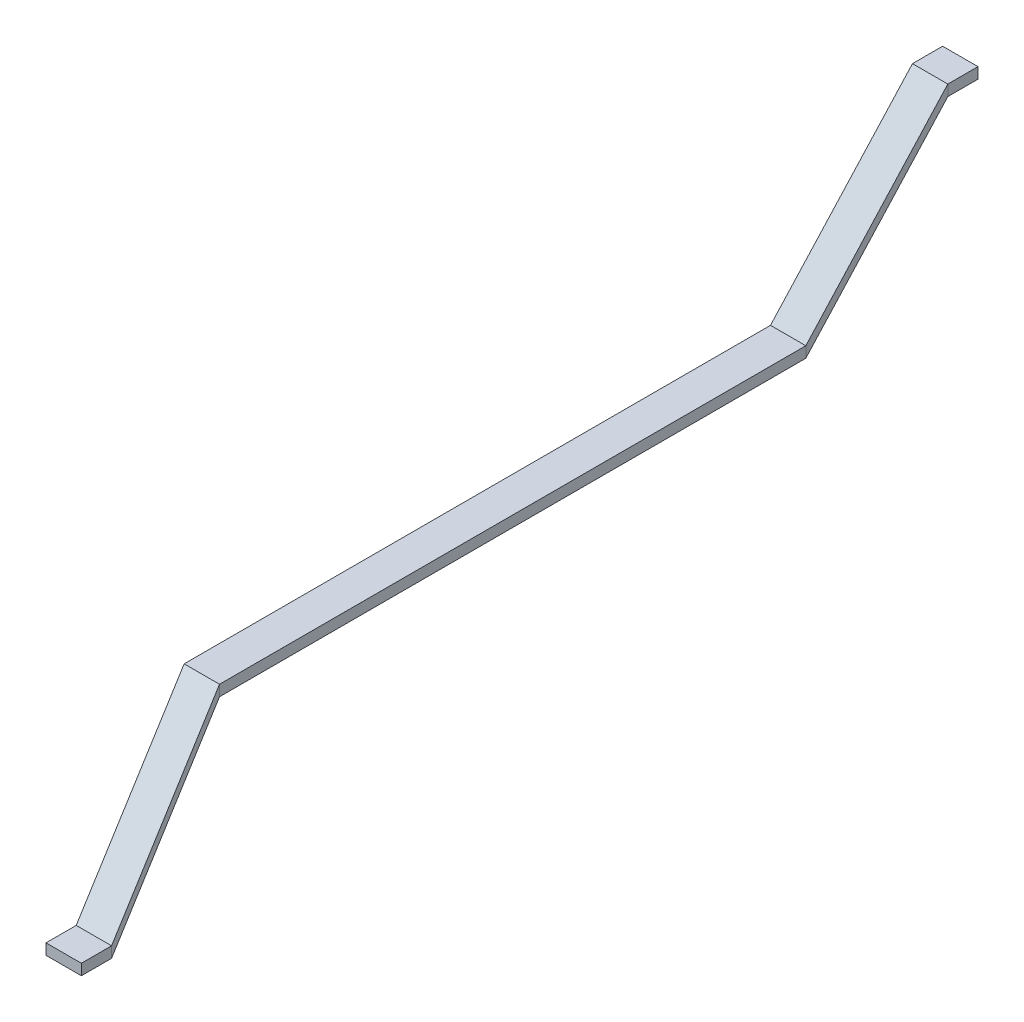
ISO-10303-21;
HEADER;
FILE_DESCRIPTION(('STEP AP214'),'2;1');
FILE_NAME('part.step','',(''),(''),'','','');
FILE_SCHEMA(('AUTOMOTIVE_DESIGN { 1 0 10303 214 1 1 1 1 }'));
ENDSEC;
DATA;
#1=APPLICATION_CONTEXT('core data for automotive mechanical design processes');
#2=APPLICATION_PROTOCOL_DEFINITION('international standard','automotive_design',2000,#1);
#3=PRODUCT_CONTEXT('',#1,'mechanical');
#4=PRODUCT('Part','Part','',(#3));
#5=PRODUCT_RELATED_PRODUCT_CATEGORY('part','',(#4));
#6=PRODUCT_DEFINITION_FORMATION('','',#4);
#7=PRODUCT_DEFINITION_CONTEXT('part definition',#1,'design');
#8=PRODUCT_DEFINITION('design','',#6,#7);
#9=PRODUCT_DEFINITION_SHAPE('','',#8);
#10=(LENGTH_UNIT() NAMED_UNIT(*) SI_UNIT(.MILLI.,.METRE.));
#11=(NAMED_UNIT(*) PLANE_ANGLE_UNIT() SI_UNIT($,.RADIAN.));
#12=(NAMED_UNIT(*) SI_UNIT($,.STERADIAN.) SOLID_ANGLE_UNIT());
#13=UNCERTAINTY_MEASURE_WITH_UNIT(LENGTH_MEASURE(1.E-05),#10,'distance_accuracy_value','');
#14=(GEOMETRIC_REPRESENTATION_CONTEXT(3) GLOBAL_UNCERTAINTY_ASSIGNED_CONTEXT((#13)) GLOBAL_UNIT_ASSIGNED_CONTEXT((#10,
#11,#12)) REPRESENTATION_CONTEXT('',''));
#15=CARTESIAN_POINT('',(0.,0.,0.));
#16=DIRECTION('',(0.,0.,1.));
#17=DIRECTION('',(1.,0.,0.));
#18=AXIS2_PLACEMENT_3D('',#15,#16,#17);
#19=CARTESIAN_POINT('',(0.,0.,-310.));
#20=DIRECTION('',(0.,0.,1.));
#21=DIRECTION('',(1.,0.,0.));
#22=AXIS2_PLACEMENT_3D('',#19,#20,#21);
#23=PLANE('',#22);
#24=DIRECTION('',(0.,-1.,0.));
#25=VECTOR('',#24,1.);
#26=CARTESIAN_POINT('',(3212.66029065679,352.155989281594,-310.));
#27=LINE('',#26,#25);
#28=CARTESIAN_POINT('',(3212.66029065679,352.155989281594,-310.));
#29=VERTEX_POINT('',#28);
#30=CARTESIAN_POINT('',(3212.66029065679,330.555989281594,-310.));
#31=VERTEX_POINT('',#30);
#32=EDGE_CURVE('E128',#29,#31,#27,.T.);
#33=ORIENTED_EDGE('',*,*,#32,.F.);
#34=DIRECTION('',(-1.,0.,0.));
#35=VECTOR('',#34,1.);
#36=CARTESIAN_POINT('',(3212.66029065679,352.155989281594,-310.));
#37=LINE('',#36,#35);
#38=CARTESIAN_POINT('',(3282.91029065679,352.155989281594,-310.));
#39=VERTEX_POINT('',#38);
#40=EDGE_CURVE('E40',#39,#29,#37,.T.);
#41=ORIENTED_EDGE('',*,*,#40,.F.);
#42=DIRECTION('',(0.,1.,0.));
#43=VECTOR('',#42,1.);
#44=CARTESIAN_POINT('',(3282.91029065679,352.155989281594,-310.));
#45=LINE('',#44,#43);
#46=CARTESIAN_POINT('',(3282.91029065679,330.555989281594,-310.));
#47=VERTEX_POINT('',#46);
#48=EDGE_CURVE('E117',#47,#39,#45,.T.);
#49=ORIENTED_EDGE('',*,*,#48,.F.);
#50=DIRECTION('',(1.,0.,0.));
#51=VECTOR('',#50,1.);
#52=CARTESIAN_POINT('',(3212.66029065679,330.555989281594,-310.));
#53=LINE('',#52,#51);
#54=EDGE_CURVE('E111',#31,#47,#53,.T.);
#55=ORIENTED_EDGE('',*,*,#54,.F.);
#56=EDGE_LOOP('',(#33,#41,#49,#55));
#57=FACE_BOUND('',#56,.T.);
#58=ADVANCED_FACE('F37',(#57),#23,.F.);
#59=CARTESIAN_POINT('',(3.39652809837787,-648.683155378033,1475.));
#60=DIRECTION('',(0.,0.,1.));
#61=DIRECTION('',(1.,0.,0.));
#62=AXIS2_PLACEMENT_3D('',#59,#60,#61);
#63=PLANE('',#62);
#64=DIRECTION('',(0.,-1.,0.));
#65=VECTOR('',#64,1.);
#66=CARTESIAN_POINT('',(3216.05681875516,-296.527166096439,1475.));
#67=LINE('',#66,#65);
#68=CARTESIAN_POINT('',(3216.05681875516,-296.527166096439,1475.));
#69=VERTEX_POINT('',#68);
#70=CARTESIAN_POINT('',(3216.05681875516,-318.127166096439,1475.));
#71=VERTEX_POINT('',#70);
#72=EDGE_CURVE('E184',#69,#71,#67,.T.);
#73=ORIENTED_EDGE('',*,*,#72,.T.);
#74=DIRECTION('',(1.,0.,0.));
#75=VECTOR('',#74,1.);
#76=CARTESIAN_POINT('',(3216.05681875516,-318.127166096439,1475.));
#77=LINE('',#76,#75);
#78=CARTESIAN_POINT('',(3286.30681875516,-318.127166096439,1475.));
#79=VERTEX_POINT('',#78);
#80=EDGE_CURVE('E213',#71,#79,#77,.T.);
#81=ORIENTED_EDGE('',*,*,#80,.T.);
#82=DIRECTION('',(0.,1.,0.));
#83=VECTOR('',#82,1.);
#84=CARTESIAN_POINT('',(3286.30681875516,-296.527166096439,1475.));
#85=LINE('',#84,#83);
#86=CARTESIAN_POINT('',(3286.30681875516,-296.527166096439,1475.));
#87=VERTEX_POINT('',#86);
#88=EDGE_CURVE('E206',#79,#87,#85,.T.);
#89=ORIENTED_EDGE('',*,*,#88,.T.);
#90=DIRECTION('',(-1.,0.,0.));
#91=VECTOR('',#90,1.);
#92=CARTESIAN_POINT('',(3216.05681875516,-296.527166096439,1475.));
#93=LINE('',#92,#91);
#94=EDGE_CURVE('E202',#87,#69,#93,.T.);
#95=ORIENTED_EDGE('',*,*,#94,.T.);
#96=EDGE_LOOP('',(#73,#81,#89,#95));
#97=FACE_BOUND('',#96,.T.);
#98=ADVANCED_FACE('F232',(#97),#63,.T.);
#99=CARTESIAN_POINT('',(3212.66029065679,352.155989281594,-250.));
#100=DIRECTION('',(1.,0.,0.));
#101=DIRECTION('',(0.,0.,-1.));
#102=AXIS2_PLACEMENT_3D('',#99,#100,#101);
#103=PLANE('',#102);
#104=DIRECTION('',(0.,0.,-1.));
#105=VECTOR('',#104,1.);
#106=CARTESIAN_POINT('',(3212.66029065679,330.555989281594,-250.));
#107=LINE('',#106,#105);
#108=CARTESIAN_POINT('',(3212.66029065679,330.555989281594,-250.));
#109=VERTEX_POINT('',#108);
#110=EDGE_CURVE('E139',#109,#31,#107,.T.);
#111=ORIENTED_EDGE('',*,*,#110,.F.);
#112=DIRECTION('',(0.,-1.,0.));
#113=VECTOR('',#112,1.);
#114=CARTESIAN_POINT('',(3212.66029065679,352.155989281594,-250.));
#115=LINE('',#114,#113);
#116=CARTESIAN_POINT('',(3212.66029065679,352.155989281594,-250.));
#117=VERTEX_POINT('',#116);
#118=EDGE_CURVE('E158',#117,#109,#115,.T.);
#119=ORIENTED_EDGE('',*,*,#118,.F.);
#120=DIRECTION('',(0.,0.,-1.));
#121=VECTOR('',#120,1.);
#122=CARTESIAN_POINT('',(3212.66029065679,352.155989281594,-250.));
#123=LINE('',#122,#121);
#124=EDGE_CURVE('E140',#117,#29,#123,.T.);
#125=ORIENTED_EDGE('',*,*,#124,.T.);
#126=ORIENTED_EDGE('',*,*,#32,.T.);
#127=EDGE_LOOP('',(#111,#119,#125,#126));
#128=FACE_BOUND('',#127,.T.);
#129=ADVANCED_FACE('F313',(#128),#103,.F.);
#130=CARTESIAN_POINT('',(3212.66029065679,330.555989281594,-250.));
#131=DIRECTION('',(0.,1.,0.));
#132=DIRECTION('',(0.,0.,1.));
#133=AXIS2_PLACEMENT_3D('',#130,#131,#132);
#134=PLANE('',#133);
#135=DIRECTION('',(0.,0.,-1.));
#136=VECTOR('',#135,1.);
#137=CARTESIAN_POINT('',(3282.91029065679,330.555989281594,-250.));
#138=LINE('',#137,#136);
#139=CARTESIAN_POINT('',(3282.91029065679,330.555989281594,-250.));
#140=VERTEX_POINT('',#139);
#141=EDGE_CURVE('E124',#140,#47,#138,.T.);
#142=ORIENTED_EDGE('',*,*,#141,.F.);
#143=DIRECTION('',(1.,0.,0.));
#144=VECTOR('',#143,1.);
#145=CARTESIAN_POINT('',(3212.66029065679,330.555989281594,-250.));
#146=LINE('',#145,#144);
#147=EDGE_CURVE('E153',#109,#140,#146,.T.);
#148=ORIENTED_EDGE('',*,*,#147,.F.);
#149=ORIENTED_EDGE('',*,*,#110,.T.);
#150=ORIENTED_EDGE('',*,*,#54,.T.);
#151=EDGE_LOOP('',(#142,#148,#149,#150));
#152=FACE_BOUND('',#151,.T.);
#153=ADVANCED_FACE('F316',(#152),#134,.F.);
#154=CARTESIAN_POINT('',(3282.91029065679,352.155989281594,-250.));
#155=DIRECTION('',(-1.,0.,0.));
#156=DIRECTION('',(0.,0.,1.));
#157=AXIS2_PLACEMENT_3D('',#154,#155,#156);
#158=PLANE('',#157);
#159=DIRECTION('',(0.,0.,-1.));
#160=VECTOR('',#159,1.);
#161=CARTESIAN_POINT('',(3282.91029065679,352.155989281594,-250.));
#162=LINE('',#161,#160);
#163=CARTESIAN_POINT('',(3282.91029065679,352.155989281594,-250.));
#164=VERTEX_POINT('',#163);
#165=EDGE_CURVE('E122',#164,#39,#162,.T.);
#166=ORIENTED_EDGE('',*,*,#165,.F.);
#167=DIRECTION('',(0.,1.,0.));
#168=VECTOR('',#167,1.);
#169=CARTESIAN_POINT('',(3282.91029065679,352.155989281594,-250.));
#170=LINE('',#169,#168);
#171=EDGE_CURVE('E148',#140,#164,#170,.T.);
#172=ORIENTED_EDGE('',*,*,#171,.F.);
#173=ORIENTED_EDGE('',*,*,#141,.T.);
#174=ORIENTED_EDGE('',*,*,#48,.T.);
#175=EDGE_LOOP('',(#166,#172,#173,#174));
#176=FACE_BOUND('',#175,.T.);
#177=ADVANCED_FACE('F119',(#176),#158,.F.);
#178=CARTESIAN_POINT('',(3212.66029065679,352.155989281594,-250.));
#179=DIRECTION('',(0.,-1.,0.));
#180=DIRECTION('',(0.,0.,-1.));
#181=AXIS2_PLACEMENT_3D('',#178,#179,#180);
#182=PLANE('',#181);
#183=ORIENTED_EDGE('',*,*,#40,.T.);
#184=ORIENTED_EDGE('',*,*,#124,.F.);
#185=DIRECTION('',(-1.,0.,0.));
#186=VECTOR('',#185,1.);
#187=CARTESIAN_POINT('',(3212.66029065679,352.155989281594,-250.));
#188=LINE('',#187,#186);
#189=EDGE_CURVE('E134',#164,#117,#188,.T.);
#190=ORIENTED_EDGE('',*,*,#189,.F.);
#191=ORIENTED_EDGE('',*,*,#165,.T.);
#192=EDGE_LOOP('',(#183,#184,#190,#191));
#193=FACE_BOUND('',#192,.T.);
#194=ADVANCED_FACE('F133',(#193),#182,.F.);
#195=CARTESIAN_POINT('',(3180.55,10.8,3.88578058618805E-13));
#196=DIRECTION('',(0.991852109035906,0.,0.127394638038751));
#197=DIRECTION('',(0.127394638038751,0.,-0.991852109035906));
#198=AXIS2_PLACEMENT_3D('',#195,#196,#197);
#199=PLANE('',#198);
#200=DIRECTION('',(0.0756731243531519,0.804460928171051,-0.58916567559287));
#201=VECTOR('',#200,1.);
#202=CARTESIAN_POINT('',(3180.55,-10.8,3.88578058618805E-13));
#203=LINE('',#202,#201);
#204=CARTESIAN_POINT('',(3180.55,-10.8,4.16333634234434E-13));
#205=VERTEX_POINT('',#204);
#206=EDGE_CURVE('E155',#205,#109,#203,.T.);
#207=ORIENTED_EDGE('',*,*,#206,.F.);
#208=DIRECTION('',(0.,-1.,0.));
#209=VECTOR('',#208,1.);
#210=CARTESIAN_POINT('',(3180.55,10.8,3.88578058618805E-13));
#211=LINE('',#210,#209);
#212=CARTESIAN_POINT('',(3180.55,10.8,4.16333634234434E-13));
#213=VERTEX_POINT('',#212);
#214=EDGE_CURVE('E178',#213,#205,#211,.T.);
#215=ORIENTED_EDGE('',*,*,#214,.F.);
#216=DIRECTION('',(0.0756731243531519,0.804460928171051,-0.58916567559287));
#217=VECTOR('',#216,1.);
#218=CARTESIAN_POINT('',(3180.55,10.8,3.88578058618805E-13));
#219=LINE('',#218,#217);
#220=EDGE_CURVE('E132',#213,#117,#219,.T.);
#221=ORIENTED_EDGE('',*,*,#220,.T.);
#222=ORIENTED_EDGE('',*,*,#118,.T.);
#223=EDGE_LOOP('',(#207,#215,#221,#222));
#224=FACE_BOUND('',#223,.T.);
#225=ADVANCED_FACE('F298',(#224),#199,.F.);
#226=CARTESIAN_POINT('',(3180.55,-10.8,3.88578058618805E-13));
#227=DIRECTION('',(0.,0.590859860858935,0.806774209321146));
#228=DIRECTION('',(0.,-0.806774209321146,0.590859860858935));
#229=AXIS2_PLACEMENT_3D('',#226,#227,#228);
#230=PLANE('',#229);
#231=DIRECTION('',(0.0756731243531519,0.804460928171051,-0.58916567559287));
#232=VECTOR('',#231,1.);
#233=CARTESIAN_POINT('',(3250.8,-10.8,3.88578058618805E-13));
#234=LINE('',#233,#232);
#235=CARTESIAN_POINT('',(3250.8,-10.8,4.16333634234434E-13));
#236=VERTEX_POINT('',#235);
#237=EDGE_CURVE('E150',#236,#140,#234,.T.);
#238=ORIENTED_EDGE('',*,*,#237,.F.);
#239=DIRECTION('',(1.,0.,0.));
#240=VECTOR('',#239,1.);
#241=CARTESIAN_POINT('',(3180.55,-10.8,3.88578058618805E-13));
#242=LINE('',#241,#240);
#243=EDGE_CURVE('E173',#205,#236,#242,.T.);
#244=ORIENTED_EDGE('',*,*,#243,.F.);
#245=ORIENTED_EDGE('',*,*,#206,.T.);
#246=ORIENTED_EDGE('',*,*,#147,.T.);
#247=EDGE_LOOP('',(#238,#244,#245,#246));
#248=FACE_BOUND('',#247,.T.);
#249=ADVANCED_FACE('F301',(#248),#230,.F.);
#250=CARTESIAN_POINT('',(3250.8,10.8,3.88578058618805E-13));
#251=DIRECTION('',(-0.991852109035906,0.,-0.127394638038751));
#252=DIRECTION('',(-0.127394638038751,0.,0.991852109035906));
#253=AXIS2_PLACEMENT_3D('',#250,#251,#252);
#254=PLANE('',#253);
#255=DIRECTION('',(0.0756731243531519,0.804460928171051,-0.58916567559287));
#256=VECTOR('',#255,1.);
#257=CARTESIAN_POINT('',(3250.8,10.8,3.88578058618805E-13));
#258=LINE('',#257,#256);
#259=CARTESIAN_POINT('',(3250.8,10.8,4.16333634234434E-13));
#260=VERTEX_POINT('',#259);
#261=EDGE_CURVE('E146',#260,#164,#258,.T.);
#262=ORIENTED_EDGE('',*,*,#261,.F.);
#263=DIRECTION('',(0.,1.,0.));
#264=VECTOR('',#263,1.);
#265=CARTESIAN_POINT('',(3250.8,10.8,3.88578058618805E-13));
#266=LINE('',#265,#264);
#267=EDGE_CURVE('E168',#236,#260,#266,.T.);
#268=ORIENTED_EDGE('',*,*,#267,.F.);
#269=ORIENTED_EDGE('',*,*,#237,.T.);
#270=ORIENTED_EDGE('',*,*,#171,.T.);
#271=EDGE_LOOP('',(#262,#268,#269,#270));
#272=FACE_BOUND('',#271,.T.);
#273=ADVANCED_FACE('F305',(#272),#254,.F.);
#274=CARTESIAN_POINT('',(3180.55,10.8,3.88578058618805E-13));
#275=DIRECTION('',(0.,-0.590859860858935,-0.806774209321146));
#276=DIRECTION('',(0.,0.806774209321146,-0.590859860858935));
#277=AXIS2_PLACEMENT_3D('',#274,#275,#276);
#278=PLANE('',#277);
#279=ORIENTED_EDGE('',*,*,#189,.T.);
#280=ORIENTED_EDGE('',*,*,#220,.F.);
#281=DIRECTION('',(-1.,0.,0.));
#282=VECTOR('',#281,1.);
#283=CARTESIAN_POINT('',(3180.55,10.8,3.88578058618805E-13));
#284=LINE('',#283,#282);
#285=EDGE_CURVE('E162',#260,#213,#284,.T.);
#286=ORIENTED_EDGE('',*,*,#285,.F.);
#287=ORIENTED_EDGE('',*,*,#261,.T.);
#288=EDGE_LOOP('',(#279,#280,#286,#287));
#289=FACE_BOUND('',#288,.T.);
#290=ADVANCED_FACE('F286',(#289),#278,.F.);
#291=CARTESIAN_POINT('',(3180.55,10.8,1165.));
#292=DIRECTION('',(1.,0.,0.));
#293=DIRECTION('',(0.,0.,-1.));
#294=AXIS2_PLACEMENT_3D('',#291,#292,#293);
#295=PLANE('',#294);
#296=DIRECTION('',(0.,0.,-1.));
#297=VECTOR('',#296,1.);
#298=CARTESIAN_POINT('',(3180.55,-10.8,1165.));
#299=LINE('',#298,#297);
#300=CARTESIAN_POINT('',(3180.55,-10.8,1165.));
#301=VERTEX_POINT('',#300);
#302=EDGE_CURVE('E175',#301,#205,#299,.T.);
#303=ORIENTED_EDGE('',*,*,#302,.F.);
#304=DIRECTION('',(0.,-1.,0.));
#305=VECTOR('',#304,1.);
#306=CARTESIAN_POINT('',(3180.55,10.8,1165.));
#307=LINE('',#306,#305);
#308=CARTESIAN_POINT('',(3180.55,10.8,1165.));
#309=VERTEX_POINT('',#308);
#310=EDGE_CURVE('E198',#309,#301,#307,.T.);
#311=ORIENTED_EDGE('',*,*,#310,.F.);
#312=DIRECTION('',(0.,0.,-1.));
#313=VECTOR('',#312,1.);
#314=CARTESIAN_POINT('',(3180.55,10.8,1165.));
#315=LINE('',#314,#313);
#316=EDGE_CURVE('E145',#309,#213,#315,.T.);
#317=ORIENTED_EDGE('',*,*,#316,.T.);
#318=ORIENTED_EDGE('',*,*,#214,.T.);
#319=EDGE_LOOP('',(#303,#311,#317,#318));
#320=FACE_BOUND('',#319,.T.);
#321=ADVANCED_FACE('F282',(#320),#295,.F.);
#322=CARTESIAN_POINT('',(3180.55,-10.8,1165.));
#323=DIRECTION('',(0.,1.,0.));
#324=DIRECTION('',(0.,0.,1.));
#325=AXIS2_PLACEMENT_3D('',#322,#323,#324);
#326=PLANE('',#325);
#327=DIRECTION('',(0.,0.,-1.));
#328=VECTOR('',#327,1.);
#329=CARTESIAN_POINT('',(3250.8,-10.8,1165.));
#330=LINE('',#329,#328);
#331=CARTESIAN_POINT('',(3250.8,-10.8,1165.));
#332=VERTEX_POINT('',#331);
#333=EDGE_CURVE('E170',#332,#236,#330,.T.);
#334=ORIENTED_EDGE('',*,*,#333,.F.);
#335=DIRECTION('',(1.,0.,0.));
#336=VECTOR('',#335,1.);
#337=CARTESIAN_POINT('',(3180.55,-10.8,1165.));
#338=LINE('',#337,#336);
#339=EDGE_CURVE('E193',#301,#332,#338,.T.);
#340=ORIENTED_EDGE('',*,*,#339,.F.);
#341=ORIENTED_EDGE('',*,*,#302,.T.);
#342=ORIENTED_EDGE('',*,*,#243,.T.);
#343=EDGE_LOOP('',(#334,#340,#341,#342));
#344=FACE_BOUND('',#343,.T.);
#345=ADVANCED_FACE('F285',(#344),#326,.F.);
#346=CARTESIAN_POINT('',(3250.8,10.8,1165.));
#347=DIRECTION('',(-1.,0.,0.));
#348=DIRECTION('',(0.,0.,1.));
#349=AXIS2_PLACEMENT_3D('',#346,#347,#348);
#350=PLANE('',#349);
#351=DIRECTION('',(0.,0.,-1.));
#352=VECTOR('',#351,1.);
#353=CARTESIAN_POINT('',(3250.8,10.8,1165.));
#354=LINE('',#353,#352);
#355=CARTESIAN_POINT('',(3250.8,10.8,1165.));
#356=VERTEX_POINT('',#355);
#357=EDGE_CURVE('E165',#356,#260,#354,.T.);
#358=ORIENTED_EDGE('',*,*,#357,.F.);
#359=DIRECTION('',(0.,1.,0.));
#360=VECTOR('',#359,1.);
#361=CARTESIAN_POINT('',(3250.8,10.8,1165.));
#362=LINE('',#361,#360);
#363=EDGE_CURVE('E188',#332,#356,#362,.T.);
#364=ORIENTED_EDGE('',*,*,#363,.F.);
#365=ORIENTED_EDGE('',*,*,#333,.T.);
#366=ORIENTED_EDGE('',*,*,#267,.T.);
#367=EDGE_LOOP('',(#358,#364,#365,#366));
#368=FACE_BOUND('',#367,.T.);
#369=ADVANCED_FACE('F290',(#368),#350,.F.);
#370=CARTESIAN_POINT('',(3180.55,10.8,1165.));
#371=DIRECTION('',(0.,-1.,0.));
#372=DIRECTION('',(0.,0.,-1.));
#373=AXIS2_PLACEMENT_3D('',#370,#371,#372);
#374=PLANE('',#373);
#375=ORIENTED_EDGE('',*,*,#285,.T.);
#376=ORIENTED_EDGE('',*,*,#316,.F.);
#377=DIRECTION('',(-1.,0.,0.));
#378=VECTOR('',#377,1.);
#379=CARTESIAN_POINT('',(3180.55,10.8,1165.));
#380=LINE('',#379,#378);
#381=EDGE_CURVE('E182',#356,#309,#380,.T.);
#382=ORIENTED_EDGE('',*,*,#381,.F.);
#383=ORIENTED_EDGE('',*,*,#357,.T.);
#384=EDGE_LOOP('',(#375,#376,#382,#383));
#385=FACE_BOUND('',#384,.T.);
#386=ADVANCED_FACE('F269',(#385),#374,.F.);
#387=CARTESIAN_POINT('',(3216.05681875516,-296.527166096439,1415.));
#388=DIRECTION('',(0.990064193344772,0.,-0.140616119476277));
#389=DIRECTION('',(-0.140616119476277,0.,-0.990064193344772));
#390=AXIS2_PLACEMENT_3D('',#387,#388,#389);
#391=PLANE('',#390);
#392=DIRECTION('',(-0.0892675896064656,0.772650333086406,-0.628524271788543));
#393=VECTOR('',#392,1.);
#394=CARTESIAN_POINT('',(3216.05681875516,-318.127166096439,1415.));
#395=LINE('',#394,#393);
#396=CARTESIAN_POINT('',(3216.05681875516,-318.127166096439,1415.));
#397=VERTEX_POINT('',#396);
#398=EDGE_CURVE('E195',#397,#301,#395,.T.);
#399=ORIENTED_EDGE('',*,*,#398,.F.);
#400=DIRECTION('',(0.,-1.,0.));
#401=VECTOR('',#400,1.);
#402=CARTESIAN_POINT('',(3216.05681875516,-296.527166096439,1415.));
#403=LINE('',#402,#401);
#404=CARTESIAN_POINT('',(3216.05681875516,-296.527166096439,1415.));
#405=VERTEX_POINT('',#404);
#406=EDGE_CURVE('E222',#405,#397,#403,.T.);
#407=ORIENTED_EDGE('',*,*,#406,.F.);
#408=DIRECTION('',(-0.0892675896064656,0.772650333086406,-0.628524271788543));
#409=VECTOR('',#408,1.);
#410=CARTESIAN_POINT('',(3216.05681875516,-296.527166096439,1415.));
#411=LINE('',#410,#409);
#412=EDGE_CURVE('E164',#405,#309,#411,.T.);
#413=ORIENTED_EDGE('',*,*,#412,.T.);
#414=ORIENTED_EDGE('',*,*,#310,.T.);
#415=EDGE_LOOP('',(#399,#407,#413,#414));
#416=FACE_BOUND('',#415,.T.);
#417=ADVANCED_FACE('F265',(#416),#391,.F.);
#418=CARTESIAN_POINT('',(3216.05681875516,-318.127166096439,1415.));
#419=DIRECTION('',(0.,0.63104360014591,0.775747365264549));
#420=DIRECTION('',(0.,-0.775747365264549,0.63104360014591));
#421=AXIS2_PLACEMENT_3D('',#418,#419,#420);
#422=PLANE('',#421);
#423=DIRECTION('',(-0.0892675896064656,0.772650333086406,-0.628524271788543));
#424=VECTOR('',#423,1.);
#425=CARTESIAN_POINT('',(3286.30681875516,-318.127166096439,1415.));
#426=LINE('',#425,#424);
#427=CARTESIAN_POINT('',(3286.30681875516,-318.127166096439,1415.));
#428=VERTEX_POINT('',#427);
#429=EDGE_CURVE('E190',#428,#332,#426,.T.);
#430=ORIENTED_EDGE('',*,*,#429,.F.);
#431=DIRECTION('',(1.,0.,0.));
#432=VECTOR('',#431,1.);
#433=CARTESIAN_POINT('',(3216.05681875516,-318.127166096439,1415.));
#434=LINE('',#433,#432);
#435=EDGE_CURVE('E215',#397,#428,#434,.T.);
#436=ORIENTED_EDGE('',*,*,#435,.F.);
#437=ORIENTED_EDGE('',*,*,#398,.T.);
#438=ORIENTED_EDGE('',*,*,#339,.T.);
#439=EDGE_LOOP('',(#430,#436,#437,#438));
#440=FACE_BOUND('',#439,.T.);
#441=ADVANCED_FACE('F268',(#440),#422,.F.);
#442=CARTESIAN_POINT('',(3286.30681875516,-296.527166096439,1415.));
#443=DIRECTION('',(-0.990064193344772,0.,0.140616119476277));
#444=DIRECTION('',(0.140616119476277,0.,0.990064193344772));
#445=AXIS2_PLACEMENT_3D('',#442,#443,#444);
#446=PLANE('',#445);
#447=DIRECTION('',(-0.0892675896064656,0.772650333086406,-0.628524271788543));
#448=VECTOR('',#447,1.);
#449=CARTESIAN_POINT('',(3286.30681875516,-296.527166096439,1415.));
#450=LINE('',#449,#448);
#451=CARTESIAN_POINT('',(3286.30681875516,-296.527166096439,1415.));
#452=VERTEX_POINT('',#451);
#453=EDGE_CURVE('E185',#452,#356,#450,.T.);
#454=ORIENTED_EDGE('',*,*,#453,.F.);
#455=DIRECTION('',(0.,1.,0.));
#456=VECTOR('',#455,1.);
#457=CARTESIAN_POINT('',(3286.30681875516,-296.527166096439,1415.));
#458=LINE('',#457,#456);
#459=EDGE_CURVE('E55',#428,#452,#458,.T.);
#460=ORIENTED_EDGE('',*,*,#459,.F.);
#461=ORIENTED_EDGE('',*,*,#429,.T.);
#462=ORIENTED_EDGE('',*,*,#363,.T.);
#463=EDGE_LOOP('',(#454,#460,#461,#462));
#464=FACE_BOUND('',#463,.T.);
#465=ADVANCED_FACE('F273',(#464),#446,.F.);
#466=CARTESIAN_POINT('',(3216.05681875516,-296.527166096439,1415.));
#467=DIRECTION('',(0.,-0.63104360014591,-0.775747365264549));
#468=DIRECTION('',(0.,0.775747365264549,-0.63104360014591));
#469=AXIS2_PLACEMENT_3D('',#466,#467,#468);
#470=PLANE('',#469);
#471=ORIENTED_EDGE('',*,*,#381,.T.);
#472=ORIENTED_EDGE('',*,*,#412,.F.);
#473=DIRECTION('',(-1.,0.,0.));
#474=VECTOR('',#473,1.);
#475=CARTESIAN_POINT('',(3216.05681875516,-296.527166096439,1415.));
#476=LINE('',#475,#474);
#477=EDGE_CURVE('E11',#452,#405,#476,.T.);
#478=ORIENTED_EDGE('',*,*,#477,.F.);
#479=ORIENTED_EDGE('',*,*,#453,.T.);
#480=EDGE_LOOP('',(#471,#472,#478,#479));
#481=FACE_BOUND('',#480,.T.);
#482=ADVANCED_FACE('F277',(#481),#470,.F.);
#483=CARTESIAN_POINT('',(3216.05681875516,-296.527166096439,1475.));
#484=DIRECTION('',(1.,0.,0.));
#485=DIRECTION('',(0.,0.,-1.));
#486=AXIS2_PLACEMENT_3D('',#483,#484,#485);
#487=PLANE('',#486);
#488=DIRECTION('',(0.,0.,-1.));
#489=VECTOR('',#488,1.);
#490=CARTESIAN_POINT('',(3216.05681875516,-318.127166096439,1475.));
#491=LINE('',#490,#489);
#492=EDGE_CURVE('E217',#71,#397,#491,.T.);
#493=ORIENTED_EDGE('',*,*,#492,.F.);
#494=ORIENTED_EDGE('',*,*,#72,.F.);
#495=DIRECTION('',(0.,0.,-1.));
#496=VECTOR('',#495,1.);
#497=CARTESIAN_POINT('',(3216.05681875516,-296.527166096439,1475.));
#498=LINE('',#497,#496);
#499=EDGE_CURVE('E205',#69,#405,#498,.T.);
#500=ORIENTED_EDGE('',*,*,#499,.T.);
#501=ORIENTED_EDGE('',*,*,#406,.T.);
#502=EDGE_LOOP('',(#493,#494,#500,#501));
#503=FACE_BOUND('',#502,.T.);
#504=ADVANCED_FACE('F240',(#503),#487,.F.);
#505=CARTESIAN_POINT('',(3216.05681875516,-318.127166096439,1475.));
#506=DIRECTION('',(0.,1.,0.));
#507=DIRECTION('',(0.,0.,1.));
#508=AXIS2_PLACEMENT_3D('',#505,#506,#507);
#509=PLANE('',#508);
#510=DIRECTION('',(0.,0.,-1.));
#511=VECTOR('',#510,1.);
#512=CARTESIAN_POINT('',(3286.30681875516,-318.127166096439,1475.));
#513=LINE('',#512,#511);
#514=EDGE_CURVE('E210',#79,#428,#513,.T.);
#515=ORIENTED_EDGE('',*,*,#514,.F.);
#516=ORIENTED_EDGE('',*,*,#80,.F.);
#517=ORIENTED_EDGE('',*,*,#492,.T.);
#518=ORIENTED_EDGE('',*,*,#435,.T.);
#519=EDGE_LOOP('',(#515,#516,#517,#518));
#520=FACE_BOUND('',#519,.T.);
#521=ADVANCED_FACE('F244',(#520),#509,.F.);
#522=CARTESIAN_POINT('',(3286.30681875516,-296.527166096439,1475.));
#523=DIRECTION('',(-1.,0.,0.));
#524=DIRECTION('',(0.,0.,1.));
#525=AXIS2_PLACEMENT_3D('',#522,#523,#524);
#526=PLANE('',#525);
#527=DIRECTION('',(0.,0.,-1.));
#528=VECTOR('',#527,1.);
#529=CARTESIAN_POINT('',(3286.30681875516,-296.527166096439,1475.));
#530=LINE('',#529,#528);
#531=EDGE_CURVE('E46',#87,#452,#530,.T.);
#532=ORIENTED_EDGE('',*,*,#531,.F.);
#533=ORIENTED_EDGE('',*,*,#88,.F.);
#534=ORIENTED_EDGE('',*,*,#514,.T.);
#535=ORIENTED_EDGE('',*,*,#459,.T.);
#536=EDGE_LOOP('',(#532,#533,#534,#535));
#537=FACE_BOUND('',#536,.T.);
#538=ADVANCED_FACE('F254',(#537),#526,.F.);
#539=CARTESIAN_POINT('',(3216.05681875516,-296.527166096439,1475.));
#540=DIRECTION('',(0.,-1.,0.));
#541=DIRECTION('',(0.,0.,-1.));
#542=AXIS2_PLACEMENT_3D('',#539,#540,#541);
#543=PLANE('',#542);
#544=ORIENTED_EDGE('',*,*,#477,.T.);
#545=ORIENTED_EDGE('',*,*,#499,.F.);
#546=ORIENTED_EDGE('',*,*,#94,.F.);
#547=ORIENTED_EDGE('',*,*,#531,.T.);
#548=EDGE_LOOP('',(#544,#545,#546,#547));
#549=FACE_BOUND('',#548,.T.);
#550=ADVANCED_FACE('F253',(#549),#543,.F.);
#551=CLOSED_SHELL('',(#58,#98,#129,#153,#177,#194,#225,#249,#273,#290,#321,#345,#369,#386,#417,
#441,#465,#482,#504,#521,#538,#550));
#552=MANIFOLD_SOLID_BREP('B2',#551);
#553=ADVANCED_BREP_SHAPE_REPRESENTATION('',(#18,#552),#14);
#554=SHAPE_DEFINITION_REPRESENTATION(#9,#553);
ENDSEC;
END-ISO-10303-21;
